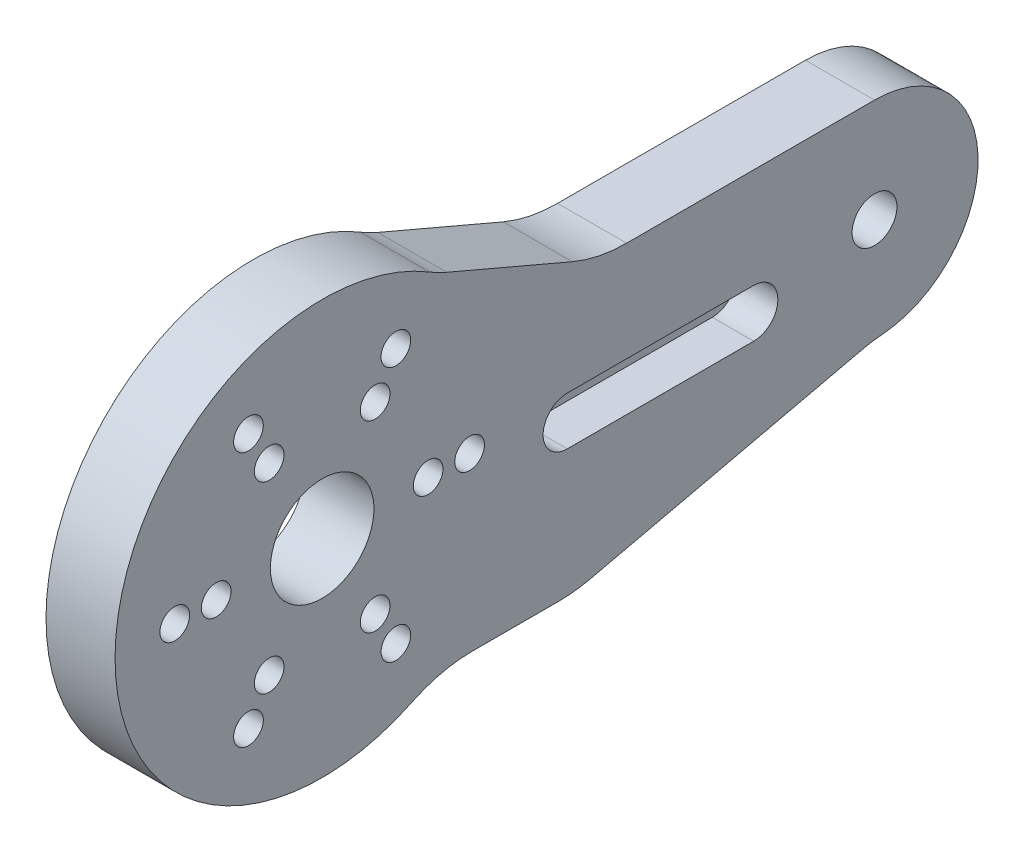
ISO-10303-21;
HEADER;
FILE_DESCRIPTION(('STEP AP214'),'2;1');
FILE_NAME('part.step','',(''),(''),'','','');
FILE_SCHEMA(('AUTOMOTIVE_DESIGN { 1 0 10303 214 1 1 1 1 }'));
ENDSEC;
DATA;
#1=APPLICATION_CONTEXT('core data for automotive mechanical design processes');
#2=APPLICATION_PROTOCOL_DEFINITION('international standard','automotive_design',2000,#1);
#3=PRODUCT_CONTEXT('',#1,'mechanical');
#4=PRODUCT('Part','Part','',(#3));
#5=PRODUCT_RELATED_PRODUCT_CATEGORY('part','',(#4));
#6=PRODUCT_DEFINITION_FORMATION('','',#4);
#7=PRODUCT_DEFINITION_CONTEXT('part definition',#1,'design');
#8=PRODUCT_DEFINITION('design','',#6,#7);
#9=PRODUCT_DEFINITION_SHAPE('','',#8);
#10=(LENGTH_UNIT() NAMED_UNIT(*) SI_UNIT(.MILLI.,.METRE.));
#11=(NAMED_UNIT(*) PLANE_ANGLE_UNIT() SI_UNIT($,.RADIAN.));
#12=(NAMED_UNIT(*) SI_UNIT($,.STERADIAN.) SOLID_ANGLE_UNIT());
#13=UNCERTAINTY_MEASURE_WITH_UNIT(LENGTH_MEASURE(1.E-05),#10,'distance_accuracy_value','');
#14=(GEOMETRIC_REPRESENTATION_CONTEXT(3) GLOBAL_UNCERTAINTY_ASSIGNED_CONTEXT((#13)) GLOBAL_UNIT_ASSIGNED_CONTEXT((#10,
#11,#12)) REPRESENTATION_CONTEXT('',''));
#15=CARTESIAN_POINT('',(0.,0.,0.));
#16=DIRECTION('',(0.,0.,1.));
#17=DIRECTION('',(1.,0.,0.));
#18=AXIS2_PLACEMENT_3D('',#15,#16,#17);
#19=CARTESIAN_POINT('',(-0.5,-1.5,-17.75));
#20=DIRECTION('',(1.,0.,0.));
#21=DIRECTION('',(0.,0.,-1.));
#22=AXIS2_PLACEMENT_3D('',#19,#20,#21);
#23=PLANE('',#22);
#24=CARTESIAN_POINT('',(-0.5,-1.5,-31.25));
#25=DIRECTION('',(1.,0.,0.));
#26=DIRECTION('',(0.,0.,-1.));
#27=AXIS2_PLACEMENT_3D('',#24,#25,#26);
#28=CIRCLE('',#27,1.75);
#29=CARTESIAN_POINT('',(-0.5,-3.25,-31.25));
#30=VERTEX_POINT('',#29);
#31=CARTESIAN_POINT('',(-0.5,0.250000000000001,-31.25));
#32=VERTEX_POINT('',#31);
#33=EDGE_CURVE('E142',#30,#32,#28,.T.);
#34=ORIENTED_EDGE('',*,*,#33,.T.);
#35=DIRECTION('',(0.,0.,1.));
#36=VECTOR('',#35,1.);
#37=CARTESIAN_POINT('',(-0.5,0.25,-17.75));
#38=LINE('',#37,#36);
#39=CARTESIAN_POINT('',(-0.5,0.25,-17.75));
#40=VERTEX_POINT('',#39);
#41=EDGE_CURVE('E132',#32,#40,#38,.T.);
#42=ORIENTED_EDGE('',*,*,#41,.T.);
#43=CARTESIAN_POINT('',(-0.5,-1.5,-17.75));
#44=DIRECTION('',(1.,0.,0.));
#45=DIRECTION('',(0.,0.,-1.));
#46=AXIS2_PLACEMENT_3D('',#43,#44,#45);
#47=CIRCLE('',#46,1.75);
#48=CARTESIAN_POINT('',(-0.5,-3.25,-17.75));
#49=VERTEX_POINT('',#48);
#50=EDGE_CURVE('E20',#40,#49,#47,.T.);
#51=ORIENTED_EDGE('',*,*,#50,.T.);
#52=DIRECTION('',(0.,0.,-1.));
#53=VECTOR('',#52,1.);
#54=CARTESIAN_POINT('',(-0.5,-3.25,-17.75));
#55=LINE('',#54,#53);
#56=EDGE_CURVE('E145',#49,#30,#55,.T.);
#57=ORIENTED_EDGE('',*,*,#56,.T.);
#58=EDGE_LOOP('',(#34,#42,#51,#57));
#59=FACE_BOUND('',#58,.T.);
#60=ADVANCED_FACE('F17',(#59),#23,.T.);
#61=CARTESIAN_POINT('',(-0.5,-1.5,-17.75));
#62=DIRECTION('',(1.,0.,0.));
#63=DIRECTION('',(0.,0.,-1.));
#64=AXIS2_PLACEMENT_3D('',#61,#62,#63);
#65=CYLINDRICAL_SURFACE('',#64,1.75);
#66=DIRECTION('',(1.,0.,0.));
#67=VECTOR('',#66,1.);
#68=CARTESIAN_POINT('',(-0.5,-3.25,-17.75));
#69=LINE('',#68,#67);
#70=CARTESIAN_POINT('',(2.5,-3.25,-17.75));
#71=VERTEX_POINT('',#70);
#72=EDGE_CURVE('E127',#71,#49,#69,.F.);
#73=ORIENTED_EDGE('',*,*,#72,.T.);
#74=ORIENTED_EDGE('',*,*,#50,.F.);
#75=DIRECTION('',(1.,0.,0.));
#76=VECTOR('',#75,1.);
#77=CARTESIAN_POINT('',(-0.5,0.25,-17.75));
#78=LINE('',#77,#76);
#79=CARTESIAN_POINT('',(2.5,0.25,-17.75));
#80=VERTEX_POINT('',#79);
#81=EDGE_CURVE('E125',#40,#80,#78,.T.);
#82=ORIENTED_EDGE('',*,*,#81,.T.);
#83=CARTESIAN_POINT('',(2.5,-1.5,-17.75));
#84=DIRECTION('',(1.,0.,0.));
#85=DIRECTION('',(0.,0.,-1.));
#86=AXIS2_PLACEMENT_3D('',#83,#84,#85);
#87=CIRCLE('',#86,1.75);
#88=EDGE_CURVE('E274',#71,#80,#87,.F.);
#89=ORIENTED_EDGE('',*,*,#88,.F.);
#90=EDGE_LOOP('',(#73,#74,#82,#89));
#91=FACE_BOUND('',#90,.T.);
#92=ADVANCED_FACE('F123',(#91),#65,.F.);
#93=CARTESIAN_POINT('',(-0.5,0.25,-17.75));
#94=DIRECTION('',(0.,1.,0.));
#95=DIRECTION('',(0.,0.,1.));
#96=AXIS2_PLACEMENT_3D('',#93,#94,#95);
#97=PLANE('',#96);
#98=ORIENTED_EDGE('',*,*,#81,.F.);
#99=ORIENTED_EDGE('',*,*,#41,.F.);
#100=DIRECTION('',(1.,0.,0.));
#101=VECTOR('',#100,1.);
#102=CARTESIAN_POINT('',(-0.5,0.250000000000001,-31.25));
#103=LINE('',#102,#101);
#104=CARTESIAN_POINT('',(2.5,0.250000000000001,-31.25));
#105=VERTEX_POINT('',#104);
#106=EDGE_CURVE('E140',#32,#105,#103,.T.);
#107=ORIENTED_EDGE('',*,*,#106,.T.);
#108=DIRECTION('',(0.,0.,-1.));
#109=VECTOR('',#108,1.);
#110=CARTESIAN_POINT('',(2.5,0.25,0.));
#111=LINE('',#110,#109);
#112=EDGE_CURVE('E139',#80,#105,#111,.T.);
#113=ORIENTED_EDGE('',*,*,#112,.F.);
#114=EDGE_LOOP('',(#98,#99,#107,#113));
#115=FACE_BOUND('',#114,.T.);
#116=ADVANCED_FACE('F135',(#115),#97,.F.);
#117=CARTESIAN_POINT('',(-0.5,-1.5,-31.25));
#118=DIRECTION('',(1.,0.,0.));
#119=DIRECTION('',(0.,0.,-1.));
#120=AXIS2_PLACEMENT_3D('',#117,#118,#119);
#121=CYLINDRICAL_SURFACE('',#120,1.75);
#122=ORIENTED_EDGE('',*,*,#33,.F.);
#123=DIRECTION('',(1.,0.,0.));
#124=VECTOR('',#123,1.);
#125=CARTESIAN_POINT('',(-0.5,-3.25,-31.25));
#126=LINE('',#125,#124);
#127=CARTESIAN_POINT('',(2.5,-3.25,-31.25));
#128=VERTEX_POINT('',#127);
#129=EDGE_CURVE('E279',#30,#128,#126,.T.);
#130=ORIENTED_EDGE('',*,*,#129,.T.);
#131=CARTESIAN_POINT('',(2.5,-1.5,-31.25));
#132=DIRECTION('',(1.,0.,0.));
#133=DIRECTION('',(0.,0.,-1.));
#134=AXIS2_PLACEMENT_3D('',#131,#132,#133);
#135=CIRCLE('',#134,1.75);
#136=EDGE_CURVE('E272',#105,#128,#135,.F.);
#137=ORIENTED_EDGE('',*,*,#136,.F.);
#138=ORIENTED_EDGE('',*,*,#106,.F.);
#139=EDGE_LOOP('',(#122,#130,#137,#138));
#140=FACE_BOUND('',#139,.T.);
#141=ADVANCED_FACE('F377',(#140),#121,.F.);
#142=CARTESIAN_POINT('',(-0.5,-3.25,-17.75));
#143=DIRECTION('',(0.,-1.,0.));
#144=DIRECTION('',(0.,0.,-1.));
#145=AXIS2_PLACEMENT_3D('',#142,#143,#144);
#146=PLANE('',#145);
#147=ORIENTED_EDGE('',*,*,#129,.F.);
#148=ORIENTED_EDGE('',*,*,#56,.F.);
#149=ORIENTED_EDGE('',*,*,#72,.F.);
#150=DIRECTION('',(0.,0.,-1.));
#151=VECTOR('',#150,1.);
#152=CARTESIAN_POINT('',(2.5,-3.25,0.));
#153=LINE('',#152,#151);
#154=EDGE_CURVE('E271',#128,#71,#153,.F.);
#155=ORIENTED_EDGE('',*,*,#154,.F.);
#156=EDGE_LOOP('',(#147,#148,#149,#155));
#157=FACE_BOUND('',#156,.T.);
#158=ADVANCED_FACE('F379',(#157),#146,.F.);
#159=CARTESIAN_POINT('',(2.5,21.3838228847909,-12.9511435337538));
#160=DIRECTION('',(-1.,0.,0.));
#161=DIRECTION('',(0.,0.,1.));
#162=AXIS2_PLACEMENT_3D('',#159,#160,#161);
#163=CYLINDRICAL_SURFACE('',#162,10.);
#164=DIRECTION('',(1.,0.,0.));
#165=VECTOR('',#164,1.);
#166=CARTESIAN_POINT('',(2.5,12.1872890829508,-9.02383325423511));
#167=LINE('',#166,#165);
#168=CARTESIAN_POINT('',(2.5,12.1872890829508,-9.02383325423511));
#169=VERTEX_POINT('',#168);
#170=CARTESIAN_POINT('',(-2.5,12.1872890829508,-9.02383325423511));
#171=VERTEX_POINT('',#170);
#172=EDGE_CURVE('E291',#169,#171,#167,.F.);
#173=ORIENTED_EDGE('',*,*,#172,.T.);
#174=CARTESIAN_POINT('',(-2.5,21.3838228847909,-12.9511435337538));
#175=DIRECTION('',(-1.,0.,0.));
#176=DIRECTION('',(0.,0.,1.));
#177=AXIS2_PLACEMENT_3D('',#174,#175,#176);
#178=CIRCLE('',#177,10.);
#179=CARTESIAN_POINT('',(-2.5,12.8302937308745,-7.77068612025227));
#180=VERTEX_POINT('',#179);
#181=EDGE_CURVE('E278',#180,#171,#178,.F.);
#182=ORIENTED_EDGE('',*,*,#181,.F.);
#183=DIRECTION('',(-1.,0.,0.));
#184=VECTOR('',#183,1.);
#185=CARTESIAN_POINT('',(2.5,12.8302937308745,-7.77068612025227));
#186=LINE('',#185,#184);
#187=CARTESIAN_POINT('',(2.5,12.8302937308745,-7.77068612025227));
#188=VERTEX_POINT('',#187);
#189=EDGE_CURVE('E257',#188,#180,#186,.T.);
#190=ORIENTED_EDGE('',*,*,#189,.F.);
#191=CARTESIAN_POINT('',(2.5,21.3838228847909,-12.9511435337538));
#192=DIRECTION('',(-1.,0.,0.));
#193=DIRECTION('',(0.,0.,1.));
#194=AXIS2_PLACEMENT_3D('',#191,#192,#193);
#195=CIRCLE('',#194,10.);
#196=EDGE_CURVE('E266',#169,#188,#195,.T.);
#197=ORIENTED_EDGE('',*,*,#196,.F.);
#198=EDGE_LOOP('',(#173,#182,#190,#197));
#199=FACE_BOUND('',#198,.T.);
#200=ADVANCED_FACE('F352',(#199),#163,.F.);
#201=CARTESIAN_POINT('',(2.5,-17.4463003681525,-41.3698917709806));
#202=DIRECTION('',(-1.,0.,0.));
#203=DIRECTION('',(0.,0.,1.));
#204=AXIS2_PLACEMENT_3D('',#201,#202,#203);
#205=CYLINDRICAL_SURFACE('',#204,10.);
#206=DIRECTION('',(1.,0.,0.));
#207=VECTOR('',#206,1.);
#208=CARTESIAN_POINT('',(2.5,-7.70144119055183,-39.1254052798805));
#209=LINE('',#208,#207);
#210=CARTESIAN_POINT('',(-2.5,-7.70144119055183,-39.1254052798805));
#211=VERTEX_POINT('',#210);
#212=CARTESIAN_POINT('',(2.5,-7.70144119055183,-39.1254052798805));
#213=VERTEX_POINT('',#212);
#214=EDGE_CURVE('E245',#211,#213,#209,.T.);
#215=ORIENTED_EDGE('',*,*,#214,.F.);
#216=CARTESIAN_POINT('',(-2.5,-17.4463003681525,-41.3698917709806));
#217=DIRECTION('',(-1.,0.,0.));
#218=DIRECTION('',(0.,0.,1.));
#219=AXIS2_PLACEMENT_3D('',#216,#217,#218);
#220=CIRCLE('',#219,10.);
#221=CARTESIAN_POINT('',(-2.5,-7.47698587206537,-40.5870964732774));
#222=VERTEX_POINT('',#221);
#223=EDGE_CURVE('E276',#222,#211,#220,.F.);
#224=ORIENTED_EDGE('',*,*,#223,.F.);
#225=DIRECTION('',(-1.,0.,0.));
#226=VECTOR('',#225,1.);
#227=CARTESIAN_POINT('',(2.5,-7.47698587206537,-40.5870964732774));
#228=LINE('',#227,#226);
#229=CARTESIAN_POINT('',(2.5,-7.47698587206537,-40.5870964732774));
#230=VERTEX_POINT('',#229);
#231=EDGE_CURVE('E265',#230,#222,#228,.T.);
#232=ORIENTED_EDGE('',*,*,#231,.F.);
#233=CARTESIAN_POINT('',(2.5,-17.4463003681525,-41.3698917709806));
#234=DIRECTION('',(-1.,0.,0.));
#235=DIRECTION('',(0.,0.,1.));
#236=AXIS2_PLACEMENT_3D('',#233,#234,#235);
#237=CIRCLE('',#236,10.);
#238=EDGE_CURVE('E269',#213,#230,#237,.T.);
#239=ORIENTED_EDGE('',*,*,#238,.F.);
#240=EDGE_LOOP('',(#215,#224,#232,#239));
#241=FACE_BOUND('',#240,.T.);
#242=ADVANCED_FACE('F367',(#241),#205,.F.);
#243=CARTESIAN_POINT('',(2.5,0.,0.));
#244=DIRECTION('',(1.,0.,0.));
#245=DIRECTION('',(0.,0.,-1.));
#246=AXIS2_PLACEMENT_3D('',#243,#244,#245);
#247=PLANE('',#246);
#248=CARTESIAN_POINT('',(2.5,0.,-40.));
#249=DIRECTION('',(-1.,0.,0.));
#250=DIRECTION('',(0.,0.,1.));
#251=AXIS2_PLACEMENT_3D('',#248,#249,#250);
#252=CIRCLE('',#251,1.625);
#253=CARTESIAN_POINT('',(2.5,0.,-38.375));
#254=VERTEX_POINT('',#253);
#255=EDGE_CURVE('E203',#254,#254,#252,.T.);
#256=ORIENTED_EDGE('',*,*,#255,.T.);
#257=EDGE_LOOP('',(#256));
#258=FACE_BOUND('',#257,.T.);
#259=CARTESIAN_POINT('',(2.5,0.,-10.675));
#260=DIRECTION('',(-1.,0.,0.));
#261=DIRECTION('',(0.,0.,1.));
#262=AXIS2_PLACEMENT_3D('',#259,#260,#261);
#263=CIRCLE('',#262,1.075);
#264=CARTESIAN_POINT('',(2.5,0.,-9.6));
#265=VERTEX_POINT('',#264);
#266=EDGE_CURVE('E206',#265,#265,#263,.T.);
#267=ORIENTED_EDGE('',*,*,#266,.T.);
#268=EDGE_LOOP('',(#267));
#269=FACE_BOUND('',#268,.T.);
#270=CARTESIAN_POINT('',(2.5,0.,-7.675));
#271=DIRECTION('',(-1.,0.,0.));
#272=DIRECTION('',(0.,0.,1.));
#273=AXIS2_PLACEMENT_3D('',#270,#271,#272);
#274=CIRCLE('',#273,1.075);
#275=CARTESIAN_POINT('',(2.5,0.,-6.6));
#276=VERTEX_POINT('',#275);
#277=EDGE_CURVE('E209',#276,#276,#274,.T.);
#278=ORIENTED_EDGE('',*,*,#277,.T.);
#279=EDGE_LOOP('',(#278));
#280=FACE_BOUND('',#279,.T.);
#281=CARTESIAN_POINT('',(2.5,0.,0.));
#282=DIRECTION('',(-1.,0.,0.));
#283=DIRECTION('',(0.,0.,1.));
#284=AXIS2_PLACEMENT_3D('',#281,#282,#283);
#285=CIRCLE('',#284,3.75);
#286=CARTESIAN_POINT('',(2.5,0.,3.75));
#287=VERTEX_POINT('',#286);
#288=EDGE_CURVE('E212',#287,#287,#285,.T.);
#289=ORIENTED_EDGE('',*,*,#288,.T.);
#290=EDGE_LOOP('',(#289));
#291=FACE_BOUND('',#290,.T.);
#292=CARTESIAN_POINT('',(2.5,-6.64674497404557,-3.8375));
#293=DIRECTION('',(-1.,0.,0.));
#294=DIRECTION('',(0.,0.,1.));
#295=AXIS2_PLACEMENT_3D('',#292,#293,#294);
#296=CIRCLE('',#295,1.075);
#297=CARTESIAN_POINT('',(2.5,-6.64674497404557,-2.7625));
#298=VERTEX_POINT('',#297);
#299=EDGE_CURVE('E215',#298,#298,#296,.T.);
#300=ORIENTED_EDGE('',*,*,#299,.T.);
#301=EDGE_LOOP('',(#300));
#302=FACE_BOUND('',#301,.T.);
#303=CARTESIAN_POINT('',(2.5,-9.24482118539888,-5.3375));
#304=DIRECTION('',(-1.,0.,0.));
#305=DIRECTION('',(0.,0.,1.));
#306=AXIS2_PLACEMENT_3D('',#303,#304,#305);
#307=CIRCLE('',#306,1.075);
#308=CARTESIAN_POINT('',(2.5,-9.24482118539888,-4.2625));
#309=VERTEX_POINT('',#308);
#310=EDGE_CURVE('E218',#309,#309,#307,.T.);
#311=ORIENTED_EDGE('',*,*,#310,.T.);
#312=EDGE_LOOP('',(#311));
#313=FACE_BOUND('',#312,.T.);
#314=CARTESIAN_POINT('',(2.5,-6.64674497404557,3.8375));
#315=DIRECTION('',(-1.,0.,0.));
#316=DIRECTION('',(0.,0.,1.));
#317=AXIS2_PLACEMENT_3D('',#314,#315,#316);
#318=CIRCLE('',#317,1.075);
#319=CARTESIAN_POINT('',(2.5,-6.64674497404557,4.9125));
#320=VERTEX_POINT('',#319);
#321=EDGE_CURVE('E221',#320,#320,#318,.T.);
#322=ORIENTED_EDGE('',*,*,#321,.T.);
#323=EDGE_LOOP('',(#322));
#324=FACE_BOUND('',#323,.T.);
#325=CARTESIAN_POINT('',(2.5,-9.24482118539888,5.3375));
#326=DIRECTION('',(-1.,0.,0.));
#327=DIRECTION('',(0.,0.,1.));
#328=AXIS2_PLACEMENT_3D('',#325,#326,#327);
#329=CIRCLE('',#328,1.075);
#330=CARTESIAN_POINT('',(2.5,-9.24482118539888,6.4125));
#331=VERTEX_POINT('',#330);
#332=EDGE_CURVE('E224',#331,#331,#329,.T.);
#333=ORIENTED_EDGE('',*,*,#332,.T.);
#334=EDGE_LOOP('',(#333));
#335=FACE_BOUND('',#334,.T.);
#336=CARTESIAN_POINT('',(2.5,0.,7.675));
#337=DIRECTION('',(-1.,0.,0.));
#338=DIRECTION('',(0.,0.,1.));
#339=AXIS2_PLACEMENT_3D('',#336,#337,#338);
#340=CIRCLE('',#339,1.075);
#341=CARTESIAN_POINT('',(2.5,0.,8.75));
#342=VERTEX_POINT('',#341);
#343=EDGE_CURVE('E227',#342,#342,#340,.T.);
#344=ORIENTED_EDGE('',*,*,#343,.T.);
#345=EDGE_LOOP('',(#344));
#346=FACE_BOUND('',#345,.T.);
#347=CARTESIAN_POINT('',(2.5,0.,10.675));
#348=DIRECTION('',(-1.,0.,0.));
#349=DIRECTION('',(0.,0.,1.));
#350=AXIS2_PLACEMENT_3D('',#347,#348,#349);
#351=CIRCLE('',#350,1.075);
#352=CARTESIAN_POINT('',(2.5,0.,11.75));
#353=VERTEX_POINT('',#352);
#354=EDGE_CURVE('E230',#353,#353,#351,.T.);
#355=ORIENTED_EDGE('',*,*,#354,.T.);
#356=EDGE_LOOP('',(#355));
#357=FACE_BOUND('',#356,.T.);
#358=CARTESIAN_POINT('',(2.5,6.64674497404556,3.8375));
#359=DIRECTION('',(-1.,0.,0.));
#360=DIRECTION('',(0.,0.,1.));
#361=AXIS2_PLACEMENT_3D('',#358,#359,#360);
#362=CIRCLE('',#361,1.075);
#363=CARTESIAN_POINT('',(2.5,6.64674497404556,4.9125));
#364=VERTEX_POINT('',#363);
#365=EDGE_CURVE('E233',#364,#364,#362,.T.);
#366=ORIENTED_EDGE('',*,*,#365,.T.);
#367=EDGE_LOOP('',(#366));
#368=FACE_BOUND('',#367,.T.);
#369=CARTESIAN_POINT('',(2.5,9.24482118539888,5.3375));
#370=DIRECTION('',(-1.,0.,0.));
#371=DIRECTION('',(0.,0.,1.));
#372=AXIS2_PLACEMENT_3D('',#369,#370,#371);
#373=CIRCLE('',#372,1.075);
#374=CARTESIAN_POINT('',(2.5,9.24482118539888,6.4125));
#375=VERTEX_POINT('',#374);
#376=EDGE_CURVE('E236',#375,#375,#373,.T.);
#377=ORIENTED_EDGE('',*,*,#376,.T.);
#378=EDGE_LOOP('',(#377));
#379=FACE_BOUND('',#378,.T.);
#380=CARTESIAN_POINT('',(2.5,6.64674497404557,-3.8375));
#381=DIRECTION('',(-1.,0.,0.));
#382=DIRECTION('',(0.,0.,1.));
#383=AXIS2_PLACEMENT_3D('',#380,#381,#382);
#384=CIRCLE('',#383,1.075);
#385=CARTESIAN_POINT('',(2.5,6.64674497404557,-2.7625));
#386=VERTEX_POINT('',#385);
#387=EDGE_CURVE('E239',#386,#386,#384,.T.);
#388=ORIENTED_EDGE('',*,*,#387,.T.);
#389=EDGE_LOOP('',(#388));
#390=FACE_BOUND('',#389,.T.);
#391=CARTESIAN_POINT('',(2.5,9.24482118539889,-5.33749999999999));
#392=DIRECTION('',(-1.,0.,0.));
#393=DIRECTION('',(0.,0.,1.));
#394=AXIS2_PLACEMENT_3D('',#391,#392,#393);
#395=CIRCLE('',#394,1.075);
#396=CARTESIAN_POINT('',(2.5,9.24482118539889,-4.26249999999999));
#397=VERTEX_POINT('',#396);
#398=EDGE_CURVE('E242',#397,#397,#395,.T.);
#399=ORIENTED_EDGE('',*,*,#398,.T.);
#400=EDGE_LOOP('',(#399));
#401=FACE_BOUND('',#400,.T.);
#402=CARTESIAN_POINT('',(2.5,0.,0.));
#403=DIRECTION('',(-1.,0.,0.));
#404=DIRECTION('',(0.,0.,1.));
#405=AXIS2_PLACEMENT_3D('',#402,#403,#404);
#406=CIRCLE('',#405,15.);
#407=CARTESIAN_POINT('',(2.5,-13.5,-6.53834841531101));
#408=VERTEX_POINT('',#407);
#409=EDGE_CURVE('E255',#408,#188,#406,.T.);
#410=ORIENTED_EDGE('',*,*,#409,.F.);
#411=CARTESIAN_POINT('',(2.5,-22.5,-10.8972473588517));
#412=DIRECTION('',(-1.,0.,0.));
#413=DIRECTION('',(0.,0.,1.));
#414=AXIS2_PLACEMENT_3D('',#411,#412,#413);
#415=CIRCLE('',#414,10.);
#416=CARTESIAN_POINT('',(2.5,-12.5,-10.8972473588517));
#417=VERTEX_POINT('',#416);
#418=EDGE_CURVE('E250',#408,#417,#415,.T.);
#419=ORIENTED_EDGE('',*,*,#418,.T.);
#420=DIRECTION('',(0.,0.,-1.));
#421=VECTOR('',#420,1.);
#422=CARTESIAN_POINT('',(2.5,-12.5,0.));
#423=LINE('',#422,#421);
#424=CARTESIAN_POINT('',(2.5,-12.5,-17.1548172308835));
#425=VERTEX_POINT('',#424);
#426=EDGE_CURVE('E253',#425,#417,#423,.F.);
#427=ORIENTED_EDGE('',*,*,#426,.F.);
#428=CARTESIAN_POINT('',(2.5,-2.5,-17.1548172308835));
#429=DIRECTION('',(-1.,0.,0.));
#430=DIRECTION('',(0.,0.,1.));
#431=AXIS2_PLACEMENT_3D('',#428,#429,#430);
#432=CIRCLE('',#431,10.);
#433=CARTESIAN_POINT('',(2.5,-12.2448591776007,-19.3993037219836));
#434=VERTEX_POINT('',#433);
#435=EDGE_CURVE('E246',#434,#425,#432,.T.);
#436=ORIENTED_EDGE('',*,*,#435,.F.);
#437=DIRECTION('',(0.,0.224448649110017,-0.974485917760071));
#438=VECTOR('',#437,1.);
#439=CARTESIAN_POINT('',(2.5,-15.8710529420645,-3.65550320212734));
#440=LINE('',#439,#438);
#441=EDGE_CURVE('E293',#213,#434,#440,.F.);
#442=ORIENTED_EDGE('',*,*,#441,.F.);
#443=ORIENTED_EDGE('',*,*,#238,.T.);
#444=CARTESIAN_POINT('',(2.5,0.,-40.));
#445=DIRECTION('',(-1.,0.,0.));
#446=DIRECTION('',(0.,0.,1.));
#447=AXIS2_PLACEMENT_3D('',#444,#445,#446);
#448=CIRCLE('',#447,7.5);
#449=CARTESIAN_POINT('',(2.5,7.5,-40.));
#450=VERTEX_POINT('',#449);
#451=EDGE_CURVE('E262',#450,#230,#448,.T.);
#452=ORIENTED_EDGE('',*,*,#451,.F.);
#453=DIRECTION('',(0.,0.,-1.));
#454=VECTOR('',#453,1.);
#455=CARTESIAN_POINT('',(2.5,7.49999999999999,0.));
#456=LINE('',#455,#454);
#457=CARTESIAN_POINT('',(2.5,7.5,-22.0458434423939));
#458=VERTEX_POINT('',#457);
#459=EDGE_CURVE('E285',#450,#458,#456,.F.);
#460=ORIENTED_EDGE('',*,*,#459,.T.);
#461=CARTESIAN_POINT('',(2.5,17.5,-22.0458434423939));
#462=DIRECTION('',(1.,0.,0.));
#463=DIRECTION('',(0.,0.,-1.));
#464=AXIS2_PLACEMENT_3D('',#461,#462,#463);
#465=CIRCLE('',#464,10.);
#466=CARTESIAN_POINT('',(2.5,8.30346619815993,-18.1185331628752));
#467=VERTEX_POINT('',#466);
#468=EDGE_CURVE('E258',#458,#467,#465,.F.);
#469=ORIENTED_EDGE('',*,*,#468,.T.);
#470=DIRECTION('',(0.,-0.392731027951867,-0.919653380184007));
#471=VECTOR('',#470,1.);
#472=CARTESIAN_POINT('',(2.5,13.5667458948105,-5.79357633651566));
#473=LINE('',#472,#471);
#474=EDGE_CURVE('E288',#467,#169,#473,.F.);
#475=ORIENTED_EDGE('',*,*,#474,.T.);
#476=ORIENTED_EDGE('',*,*,#196,.T.);
#477=EDGE_LOOP('',(#410,#419,#427,#436,#442,#443,#452,#460,#469,#475,#476));
#478=FACE_BOUND('',#477,.T.);
#479=ORIENTED_EDGE('',*,*,#136,.T.);
#480=ORIENTED_EDGE('',*,*,#154,.T.);
#481=ORIENTED_EDGE('',*,*,#88,.T.);
#482=ORIENTED_EDGE('',*,*,#112,.T.);
#483=EDGE_LOOP('',(#479,#480,#481,#482));
#484=FACE_BOUND('',#483,.T.);
#485=ADVANCED_FACE('F369',(#258,#269,#280,#291,#302,#313,#324,#335,#346,#357,#368,#379,#390,
#401,#478,#484),#247,.T.);
#486=CARTESIAN_POINT('',(2.5,0.,-40.));
#487=DIRECTION('',(-1.,0.,0.));
#488=DIRECTION('',(0.,0.,1.));
#489=AXIS2_PLACEMENT_3D('',#486,#487,#488);
#490=CYLINDRICAL_SURFACE('',#489,7.5);
#491=CARTESIAN_POINT('',(-2.5,0.,-40.));
#492=DIRECTION('',(-1.,0.,0.));
#493=DIRECTION('',(0.,0.,1.));
#494=AXIS2_PLACEMENT_3D('',#491,#492,#493);
#495=CIRCLE('',#494,7.5);
#496=CARTESIAN_POINT('',(-2.5,7.5,-40.));
#497=VERTEX_POINT('',#496);
#498=EDGE_CURVE('E200',#222,#497,#495,.F.);
#499=ORIENTED_EDGE('',*,*,#498,.T.);
#500=DIRECTION('',(1.,0.,0.));
#501=VECTOR('',#500,1.);
#502=CARTESIAN_POINT('',(2.5,7.5,-40.));
#503=LINE('',#502,#501);
#504=EDGE_CURVE('E287',#497,#450,#503,.T.);
#505=ORIENTED_EDGE('',*,*,#504,.T.);
#506=ORIENTED_EDGE('',*,*,#451,.T.);
#507=ORIENTED_EDGE('',*,*,#231,.T.);
#508=EDGE_LOOP('',(#499,#505,#506,#507));
#509=FACE_BOUND('',#508,.T.);
#510=ADVANCED_FACE('F364',(#509),#490,.T.);
#511=CARTESIAN_POINT('',(2.5,7.49999999999999,0.));
#512=DIRECTION('',(0.,-1.,0.));
#513=DIRECTION('',(0.,0.,-1.));
#514=AXIS2_PLACEMENT_3D('',#511,#512,#513);
#515=PLANE('',#514);
#516=DIRECTION('',(1.,0.,0.));
#517=VECTOR('',#516,1.);
#518=CARTESIAN_POINT('',(2.5,7.5,-22.0458434423939));
#519=LINE('',#518,#517);
#520=CARTESIAN_POINT('',(-2.5,7.5,-22.0458434423939));
#521=VERTEX_POINT('',#520);
#522=EDGE_CURVE('E261',#521,#458,#519,.T.);
#523=ORIENTED_EDGE('',*,*,#522,.T.);
#524=ORIENTED_EDGE('',*,*,#459,.F.);
#525=ORIENTED_EDGE('',*,*,#504,.F.);
#526=DIRECTION('',(0.,0.,-1.));
#527=VECTOR('',#526,1.);
#528=CARTESIAN_POINT('',(-2.5,7.5,0.));
#529=LINE('',#528,#527);
#530=EDGE_CURVE('E199',#497,#521,#529,.F.);
#531=ORIENTED_EDGE('',*,*,#530,.T.);
#532=EDGE_LOOP('',(#523,#524,#525,#531));
#533=FACE_BOUND('',#532,.T.);
#534=ADVANCED_FACE('F361',(#533),#515,.F.);
#535=CARTESIAN_POINT('',(2.5,17.5,-22.0458434423939));
#536=DIRECTION('',(1.,0.,0.));
#537=DIRECTION('',(0.,0.,-1.));
#538=AXIS2_PLACEMENT_3D('',#535,#536,#537);
#539=CYLINDRICAL_SURFACE('',#538,10.);
#540=ORIENTED_EDGE('',*,*,#522,.F.);
#541=CARTESIAN_POINT('',(-2.5,17.5,-22.0458434423939));
#542=DIRECTION('',(1.,0.,0.));
#543=DIRECTION('',(0.,0.,-1.));
#544=AXIS2_PLACEMENT_3D('',#541,#542,#543);
#545=CIRCLE('',#544,10.);
#546=CARTESIAN_POINT('',(-2.5,8.30346619815993,-18.1185331628752));
#547=VERTEX_POINT('',#546);
#548=EDGE_CURVE('E196',#521,#547,#545,.F.);
#549=ORIENTED_EDGE('',*,*,#548,.T.);
#550=DIRECTION('',(1.,0.,0.));
#551=VECTOR('',#550,1.);
#552=CARTESIAN_POINT('',(2.5,8.30346619815993,-18.1185331628752));
#553=LINE('',#552,#551);
#554=EDGE_CURVE('E260',#547,#467,#553,.T.);
#555=ORIENTED_EDGE('',*,*,#554,.T.);
#556=ORIENTED_EDGE('',*,*,#468,.F.);
#557=EDGE_LOOP('',(#540,#549,#555,#556));
#558=FACE_BOUND('',#557,.T.);
#559=ADVANCED_FACE('F358',(#558),#539,.F.);
#560=CARTESIAN_POINT('',(2.5,13.5667458948105,-5.79357633651566));
#561=DIRECTION('',(0.,-0.919653380184007,0.392731027951867));
#562=DIRECTION('',(0.,-0.392731027951867,-0.919653380184007));
#563=AXIS2_PLACEMENT_3D('',#560,#561,#562);
#564=PLANE('',#563);
#565=ORIENTED_EDGE('',*,*,#172,.F.);
#566=ORIENTED_EDGE('',*,*,#474,.F.);
#567=ORIENTED_EDGE('',*,*,#554,.F.);
#568=DIRECTION('',(0.,0.392731027951867,0.919653380184007));
#569=VECTOR('',#568,1.);
#570=CARTESIAN_POINT('',(-2.5,8.30346619815993,-18.1185331628752));
#571=LINE('',#570,#569);
#572=EDGE_CURVE('E195',#547,#171,#571,.T.);
#573=ORIENTED_EDGE('',*,*,#572,.T.);
#574=EDGE_LOOP('',(#565,#566,#567,#573));
#575=FACE_BOUND('',#574,.T.);
#576=ADVANCED_FACE('F355',(#575),#564,.F.);
#577=CARTESIAN_POINT('',(2.5,0.,0.));
#578=DIRECTION('',(-1.,0.,0.));
#579=DIRECTION('',(0.,0.,1.));
#580=AXIS2_PLACEMENT_3D('',#577,#578,#579);
#581=CYLINDRICAL_SURFACE('',#580,15.);
#582=CARTESIAN_POINT('',(-2.5,0.,0.));
#583=DIRECTION('',(-1.,0.,0.));
#584=DIRECTION('',(0.,0.,1.));
#585=AXIS2_PLACEMENT_3D('',#582,#583,#584);
#586=CIRCLE('',#585,15.);
#587=CARTESIAN_POINT('',(-2.5,-13.5,-6.53834841531101));
#588=VERTEX_POINT('',#587);
#589=EDGE_CURVE('E193',#180,#588,#586,.F.);
#590=ORIENTED_EDGE('',*,*,#589,.T.);
#591=DIRECTION('',(-1.,0.,0.));
#592=VECTOR('',#591,1.);
#593=CARTESIAN_POINT('',(2.5,-13.5,-6.53834841531101));
#594=LINE('',#593,#592);
#595=EDGE_CURVE('E254',#588,#408,#594,.F.);
#596=ORIENTED_EDGE('',*,*,#595,.T.);
#597=ORIENTED_EDGE('',*,*,#409,.T.);
#598=ORIENTED_EDGE('',*,*,#189,.T.);
#599=EDGE_LOOP('',(#590,#596,#597,#598));
#600=FACE_BOUND('',#599,.T.);
#601=ADVANCED_FACE('F346',(#600),#581,.T.);
#602=CARTESIAN_POINT('',(2.5,-22.5,-10.8972473588517));
#603=DIRECTION('',(-1.,0.,0.));
#604=DIRECTION('',(0.,0.,1.));
#605=AXIS2_PLACEMENT_3D('',#602,#603,#604);
#606=CYLINDRICAL_SURFACE('',#605,10.);
#607=ORIENTED_EDGE('',*,*,#595,.F.);
#608=CARTESIAN_POINT('',(-2.5,-22.5,-10.8972473588517));
#609=DIRECTION('',(-1.,0.,0.));
#610=DIRECTION('',(0.,0.,1.));
#611=AXIS2_PLACEMENT_3D('',#608,#609,#610);
#612=CIRCLE('',#611,10.);
#613=CARTESIAN_POINT('',(-2.5,-12.5,-10.8972473588517));
#614=VERTEX_POINT('',#613);
#615=EDGE_CURVE('E190',#588,#614,#612,.T.);
#616=ORIENTED_EDGE('',*,*,#615,.T.);
#617=DIRECTION('',(1.,0.,0.));
#618=VECTOR('',#617,1.);
#619=CARTESIAN_POINT('',(2.5,-12.5,-10.8972473588517));
#620=LINE('',#619,#618);
#621=EDGE_CURVE('E249',#417,#614,#620,.F.);
#622=ORIENTED_EDGE('',*,*,#621,.F.);
#623=ORIENTED_EDGE('',*,*,#418,.F.);
#624=EDGE_LOOP('',(#607,#616,#622,#623));
#625=FACE_BOUND('',#624,.T.);
#626=ADVANCED_FACE('F343',(#625),#606,.F.);
#627=CARTESIAN_POINT('',(2.5,-12.5,0.));
#628=DIRECTION('',(0.,-1.,0.));
#629=DIRECTION('',(0.,0.,-1.));
#630=AXIS2_PLACEMENT_3D('',#627,#628,#629);
#631=PLANE('',#630);
#632=ORIENTED_EDGE('',*,*,#426,.T.);
#633=ORIENTED_EDGE('',*,*,#621,.T.);
#634=DIRECTION('',(0.,0.,-1.));
#635=VECTOR('',#634,1.);
#636=CARTESIAN_POINT('',(-2.5,-12.5,0.));
#637=LINE('',#636,#635);
#638=CARTESIAN_POINT('',(-2.5,-12.5,-17.1548172308835));
#639=VERTEX_POINT('',#638);
#640=EDGE_CURVE('E189',#614,#639,#637,.T.);
#641=ORIENTED_EDGE('',*,*,#640,.T.);
#642=DIRECTION('',(-1.,0.,0.));
#643=VECTOR('',#642,1.);
#644=CARTESIAN_POINT('',(2.5,-12.5,-17.1548172308835));
#645=LINE('',#644,#643);
#646=EDGE_CURVE('E248',#425,#639,#645,.T.);
#647=ORIENTED_EDGE('',*,*,#646,.F.);
#648=EDGE_LOOP('',(#632,#633,#641,#647));
#649=FACE_BOUND('',#648,.T.);
#650=ADVANCED_FACE('F337',(#649),#631,.T.);
#651=CARTESIAN_POINT('',(2.5,-2.5,-17.1548172308835));
#652=DIRECTION('',(-1.,0.,0.));
#653=DIRECTION('',(0.,0.,1.));
#654=AXIS2_PLACEMENT_3D('',#651,#652,#653);
#655=CYLINDRICAL_SURFACE('',#654,10.);
#656=CARTESIAN_POINT('',(-2.5,-2.5,-17.1548172308835));
#657=DIRECTION('',(-1.,0.,0.));
#658=DIRECTION('',(0.,0.,1.));
#659=AXIS2_PLACEMENT_3D('',#656,#657,#658);
#660=CIRCLE('',#659,10.);
#661=CARTESIAN_POINT('',(-2.5,-12.2448591776007,-19.3993037219836));
#662=VERTEX_POINT('',#661);
#663=EDGE_CURVE('E186',#639,#662,#660,.F.);
#664=ORIENTED_EDGE('',*,*,#663,.T.);
#665=DIRECTION('',(1.,0.,0.));
#666=VECTOR('',#665,1.);
#667=CARTESIAN_POINT('',(2.5,-12.2448591776007,-19.3993037219836));
#668=LINE('',#667,#666);
#669=EDGE_CURVE('E35',#434,#662,#668,.F.);
#670=ORIENTED_EDGE('',*,*,#669,.F.);
#671=ORIENTED_EDGE('',*,*,#435,.T.);
#672=ORIENTED_EDGE('',*,*,#646,.T.);
#673=EDGE_LOOP('',(#664,#670,#671,#672));
#674=FACE_BOUND('',#673,.T.);
#675=ADVANCED_FACE('F332',(#674),#655,.T.);
#676=CARTESIAN_POINT('',(2.5,-15.8710529420645,-3.65550320212734));
#677=DIRECTION('',(0.,-0.974485917760071,-0.224448649110017));
#678=DIRECTION('',(0.,0.224448649110017,-0.974485917760071));
#679=AXIS2_PLACEMENT_3D('',#676,#677,#678);
#680=PLANE('',#679);
#681=DIRECTION('',(0.,0.224448649110017,-0.974485917760071));
#682=VECTOR('',#681,1.);
#683=CARTESIAN_POINT('',(-2.5,-12.2448591776007,-19.3993037219836));
#684=LINE('',#683,#682);
#685=EDGE_CURVE('E185',#662,#211,#684,.T.);
#686=ORIENTED_EDGE('',*,*,#685,.T.);
#687=ORIENTED_EDGE('',*,*,#214,.T.);
#688=ORIENTED_EDGE('',*,*,#441,.T.);
#689=ORIENTED_EDGE('',*,*,#669,.T.);
#690=EDGE_LOOP('',(#686,#687,#688,#689));
#691=FACE_BOUND('',#690,.T.);
#692=ADVANCED_FACE('F323',(#691),#680,.T.);
#693=CARTESIAN_POINT('',(2.5,9.24482118539889,-5.33749999999999));
#694=DIRECTION('',(-1.,0.,0.));
#695=DIRECTION('',(0.,0.,1.));
#696=AXIS2_PLACEMENT_3D('',#693,#694,#695);
#697=CYLINDRICAL_SURFACE('',#696,1.075);
#698=CARTESIAN_POINT('',(-2.5,9.24482118539889,-5.33749999999999));
#699=DIRECTION('',(-1.,0.,0.));
#700=DIRECTION('',(0.,0.,1.));
#701=AXIS2_PLACEMENT_3D('',#698,#699,#700);
#702=CIRCLE('',#701,1.075);
#703=CARTESIAN_POINT('',(-2.5,9.24482118539889,-4.26249999999999));
#704=VERTEX_POINT('',#703);
#705=EDGE_CURVE('E182',#704,#704,#702,.T.);
#706=ORIENTED_EDGE('',*,*,#705,.T.);
#707=EDGE_LOOP('',(#706));
#708=FACE_BOUND('',#707,.T.);
#709=ORIENTED_EDGE('',*,*,#398,.F.);
#710=EDGE_LOOP('',(#709));
#711=FACE_BOUND('',#710,.T.);
#712=ADVANCED_FACE('F448',(#708,#711),#697,.F.);
#713=CARTESIAN_POINT('',(2.5,6.64674497404557,-3.8375));
#714=DIRECTION('',(-1.,0.,0.));
#715=DIRECTION('',(0.,0.,1.));
#716=AXIS2_PLACEMENT_3D('',#713,#714,#715);
#717=CYLINDRICAL_SURFACE('',#716,1.075);
#718=CARTESIAN_POINT('',(-2.5,6.64674497404557,-3.8375));
#719=DIRECTION('',(-1.,0.,0.));
#720=DIRECTION('',(0.,0.,1.));
#721=AXIS2_PLACEMENT_3D('',#718,#719,#720);
#722=CIRCLE('',#721,1.075);
#723=CARTESIAN_POINT('',(-2.5,6.64674497404557,-2.7625));
#724=VERTEX_POINT('',#723);
#725=EDGE_CURVE('E179',#724,#724,#722,.T.);
#726=ORIENTED_EDGE('',*,*,#725,.T.);
#727=EDGE_LOOP('',(#726));
#728=FACE_BOUND('',#727,.T.);
#729=ORIENTED_EDGE('',*,*,#387,.F.);
#730=EDGE_LOOP('',(#729));
#731=FACE_BOUND('',#730,.T.);
#732=ADVANCED_FACE('F444',(#728,#731),#717,.F.);
#733=CARTESIAN_POINT('',(2.5,9.24482118539888,5.3375));
#734=DIRECTION('',(-1.,0.,0.));
#735=DIRECTION('',(0.,0.,1.));
#736=AXIS2_PLACEMENT_3D('',#733,#734,#735);
#737=CYLINDRICAL_SURFACE('',#736,1.075);
#738=CARTESIAN_POINT('',(-2.5,9.24482118539888,5.3375));
#739=DIRECTION('',(-1.,0.,0.));
#740=DIRECTION('',(0.,0.,1.));
#741=AXIS2_PLACEMENT_3D('',#738,#739,#740);
#742=CIRCLE('',#741,1.075);
#743=CARTESIAN_POINT('',(-2.5,9.24482118539888,6.4125));
#744=VERTEX_POINT('',#743);
#745=EDGE_CURVE('E176',#744,#744,#742,.T.);
#746=ORIENTED_EDGE('',*,*,#745,.T.);
#747=EDGE_LOOP('',(#746));
#748=FACE_BOUND('',#747,.T.);
#749=ORIENTED_EDGE('',*,*,#376,.F.);
#750=EDGE_LOOP('',(#749));
#751=FACE_BOUND('',#750,.T.);
#752=ADVANCED_FACE('F440',(#748,#751),#737,.F.);
#753=CARTESIAN_POINT('',(2.5,6.64674497404556,3.8375));
#754=DIRECTION('',(-1.,0.,0.));
#755=DIRECTION('',(0.,0.,1.));
#756=AXIS2_PLACEMENT_3D('',#753,#754,#755);
#757=CYLINDRICAL_SURFACE('',#756,1.075);
#758=CARTESIAN_POINT('',(-2.5,6.64674497404556,3.8375));
#759=DIRECTION('',(-1.,0.,0.));
#760=DIRECTION('',(0.,0.,1.));
#761=AXIS2_PLACEMENT_3D('',#758,#759,#760);
#762=CIRCLE('',#761,1.075);
#763=CARTESIAN_POINT('',(-2.5,6.64674497404556,4.9125));
#764=VERTEX_POINT('',#763);
#765=EDGE_CURVE('E173',#764,#764,#762,.T.);
#766=ORIENTED_EDGE('',*,*,#765,.T.);
#767=EDGE_LOOP('',(#766));
#768=FACE_BOUND('',#767,.T.);
#769=ORIENTED_EDGE('',*,*,#365,.F.);
#770=EDGE_LOOP('',(#769));
#771=FACE_BOUND('',#770,.T.);
#772=ADVANCED_FACE('F436',(#768,#771),#757,.F.);
#773=CARTESIAN_POINT('',(2.5,0.,10.675));
#774=DIRECTION('',(-1.,0.,0.));
#775=DIRECTION('',(0.,0.,1.));
#776=AXIS2_PLACEMENT_3D('',#773,#774,#775);
#777=CYLINDRICAL_SURFACE('',#776,1.075);
#778=CARTESIAN_POINT('',(-2.5,0.,10.675));
#779=DIRECTION('',(-1.,0.,0.));
#780=DIRECTION('',(0.,0.,1.));
#781=AXIS2_PLACEMENT_3D('',#778,#779,#780);
#782=CIRCLE('',#781,1.075);
#783=CARTESIAN_POINT('',(-2.5,0.,11.75));
#784=VERTEX_POINT('',#783);
#785=EDGE_CURVE('E170',#784,#784,#782,.T.);
#786=ORIENTED_EDGE('',*,*,#785,.T.);
#787=EDGE_LOOP('',(#786));
#788=FACE_BOUND('',#787,.T.);
#789=ORIENTED_EDGE('',*,*,#354,.F.);
#790=EDGE_LOOP('',(#789));
#791=FACE_BOUND('',#790,.T.);
#792=ADVANCED_FACE('F432',(#788,#791),#777,.F.);
#793=CARTESIAN_POINT('',(2.5,0.,7.675));
#794=DIRECTION('',(-1.,0.,0.));
#795=DIRECTION('',(0.,0.,1.));
#796=AXIS2_PLACEMENT_3D('',#793,#794,#795);
#797=CYLINDRICAL_SURFACE('',#796,1.075);
#798=CARTESIAN_POINT('',(-2.5,0.,7.675));
#799=DIRECTION('',(-1.,0.,0.));
#800=DIRECTION('',(0.,0.,1.));
#801=AXIS2_PLACEMENT_3D('',#798,#799,#800);
#802=CIRCLE('',#801,1.075);
#803=CARTESIAN_POINT('',(-2.5,0.,8.75));
#804=VERTEX_POINT('',#803);
#805=EDGE_CURVE('E167',#804,#804,#802,.T.);
#806=ORIENTED_EDGE('',*,*,#805,.T.);
#807=EDGE_LOOP('',(#806));
#808=FACE_BOUND('',#807,.T.);
#809=ORIENTED_EDGE('',*,*,#343,.F.);
#810=EDGE_LOOP('',(#809));
#811=FACE_BOUND('',#810,.T.);
#812=ADVANCED_FACE('F428',(#808,#811),#797,.F.);
#813=CARTESIAN_POINT('',(2.5,-9.24482118539888,5.3375));
#814=DIRECTION('',(-1.,0.,0.));
#815=DIRECTION('',(0.,0.,1.));
#816=AXIS2_PLACEMENT_3D('',#813,#814,#815);
#817=CYLINDRICAL_SURFACE('',#816,1.075);
#818=CARTESIAN_POINT('',(-2.5,-9.24482118539888,5.3375));
#819=DIRECTION('',(-1.,0.,0.));
#820=DIRECTION('',(0.,0.,1.));
#821=AXIS2_PLACEMENT_3D('',#818,#819,#820);
#822=CIRCLE('',#821,1.075);
#823=CARTESIAN_POINT('',(-2.5,-9.24482118539888,6.4125));
#824=VERTEX_POINT('',#823);
#825=EDGE_CURVE('E164',#824,#824,#822,.T.);
#826=ORIENTED_EDGE('',*,*,#825,.T.);
#827=EDGE_LOOP('',(#826));
#828=FACE_BOUND('',#827,.T.);
#829=ORIENTED_EDGE('',*,*,#332,.F.);
#830=EDGE_LOOP('',(#829));
#831=FACE_BOUND('',#830,.T.);
#832=ADVANCED_FACE('F424',(#828,#831),#817,.F.);
#833=CARTESIAN_POINT('',(2.5,-6.64674497404557,3.8375));
#834=DIRECTION('',(-1.,0.,0.));
#835=DIRECTION('',(0.,0.,1.));
#836=AXIS2_PLACEMENT_3D('',#833,#834,#835);
#837=CYLINDRICAL_SURFACE('',#836,1.075);
#838=CARTESIAN_POINT('',(-2.5,-6.64674497404557,3.8375));
#839=DIRECTION('',(-1.,0.,0.));
#840=DIRECTION('',(0.,0.,1.));
#841=AXIS2_PLACEMENT_3D('',#838,#839,#840);
#842=CIRCLE('',#841,1.075);
#843=CARTESIAN_POINT('',(-2.5,-6.64674497404557,4.9125));
#844=VERTEX_POINT('',#843);
#845=EDGE_CURVE('E161',#844,#844,#842,.T.);
#846=ORIENTED_EDGE('',*,*,#845,.T.);
#847=EDGE_LOOP('',(#846));
#848=FACE_BOUND('',#847,.T.);
#849=ORIENTED_EDGE('',*,*,#321,.F.);
#850=EDGE_LOOP('',(#849));
#851=FACE_BOUND('',#850,.T.);
#852=ADVANCED_FACE('F420',(#848,#851),#837,.F.);
#853=CARTESIAN_POINT('',(2.5,-9.24482118539888,-5.3375));
#854=DIRECTION('',(-1.,0.,0.));
#855=DIRECTION('',(0.,0.,1.));
#856=AXIS2_PLACEMENT_3D('',#853,#854,#855);
#857=CYLINDRICAL_SURFACE('',#856,1.075);
#858=CARTESIAN_POINT('',(-2.5,-9.24482118539888,-5.3375));
#859=DIRECTION('',(-1.,0.,0.));
#860=DIRECTION('',(0.,0.,1.));
#861=AXIS2_PLACEMENT_3D('',#858,#859,#860);
#862=CIRCLE('',#861,1.075);
#863=CARTESIAN_POINT('',(-2.5,-9.24482118539888,-4.2625));
#864=VERTEX_POINT('',#863);
#865=EDGE_CURVE('E158',#864,#864,#862,.T.);
#866=ORIENTED_EDGE('',*,*,#865,.T.);
#867=EDGE_LOOP('',(#866));
#868=FACE_BOUND('',#867,.T.);
#869=ORIENTED_EDGE('',*,*,#310,.F.);
#870=EDGE_LOOP('',(#869));
#871=FACE_BOUND('',#870,.T.);
#872=ADVANCED_FACE('F416',(#868,#871),#857,.F.);
#873=CARTESIAN_POINT('',(2.5,-6.64674497404557,-3.8375));
#874=DIRECTION('',(-1.,0.,0.));
#875=DIRECTION('',(0.,0.,1.));
#876=AXIS2_PLACEMENT_3D('',#873,#874,#875);
#877=CYLINDRICAL_SURFACE('',#876,1.075);
#878=CARTESIAN_POINT('',(-2.5,-6.64674497404557,-3.8375));
#879=DIRECTION('',(-1.,0.,0.));
#880=DIRECTION('',(0.,0.,1.));
#881=AXIS2_PLACEMENT_3D('',#878,#879,#880);
#882=CIRCLE('',#881,1.075);
#883=CARTESIAN_POINT('',(-2.5,-6.64674497404557,-2.7625));
#884=VERTEX_POINT('',#883);
#885=EDGE_CURVE('E155',#884,#884,#882,.T.);
#886=ORIENTED_EDGE('',*,*,#885,.T.);
#887=EDGE_LOOP('',(#886));
#888=FACE_BOUND('',#887,.T.);
#889=ORIENTED_EDGE('',*,*,#299,.F.);
#890=EDGE_LOOP('',(#889));
#891=FACE_BOUND('',#890,.T.);
#892=ADVANCED_FACE('F412',(#888,#891),#877,.F.);
#893=CARTESIAN_POINT('',(2.5,0.,0.));
#894=DIRECTION('',(-1.,0.,0.));
#895=DIRECTION('',(0.,0.,1.));
#896=AXIS2_PLACEMENT_3D('',#893,#894,#895);
#897=CYLINDRICAL_SURFACE('',#896,3.75);
#898=CARTESIAN_POINT('',(-2.5,0.,0.));
#899=DIRECTION('',(-1.,0.,0.));
#900=DIRECTION('',(0.,0.,1.));
#901=AXIS2_PLACEMENT_3D('',#898,#899,#900);
#902=CIRCLE('',#901,3.75);
#903=CARTESIAN_POINT('',(-2.5,0.,3.75));
#904=VERTEX_POINT('',#903);
#905=EDGE_CURVE('E152',#904,#904,#902,.T.);
#906=ORIENTED_EDGE('',*,*,#905,.T.);
#907=EDGE_LOOP('',(#906));
#908=FACE_BOUND('',#907,.T.);
#909=ORIENTED_EDGE('',*,*,#288,.F.);
#910=EDGE_LOOP('',(#909));
#911=FACE_BOUND('',#910,.T.);
#912=ADVANCED_FACE('F408',(#908,#911),#897,.F.);
#913=CARTESIAN_POINT('',(2.5,0.,-7.675));
#914=DIRECTION('',(-1.,0.,0.));
#915=DIRECTION('',(0.,0.,1.));
#916=AXIS2_PLACEMENT_3D('',#913,#914,#915);
#917=CYLINDRICAL_SURFACE('',#916,1.075);
#918=CARTESIAN_POINT('',(-2.5,0.,-7.675));
#919=DIRECTION('',(-1.,0.,0.));
#920=DIRECTION('',(0.,0.,1.));
#921=AXIS2_PLACEMENT_3D('',#918,#919,#920);
#922=CIRCLE('',#921,1.075);
#923=CARTESIAN_POINT('',(-2.5,0.,-6.6));
#924=VERTEX_POINT('',#923);
#925=EDGE_CURVE('E149',#924,#924,#922,.T.);
#926=ORIENTED_EDGE('',*,*,#925,.T.);
#927=EDGE_LOOP('',(#926));
#928=FACE_BOUND('',#927,.T.);
#929=ORIENTED_EDGE('',*,*,#277,.F.);
#930=EDGE_LOOP('',(#929));
#931=FACE_BOUND('',#930,.T.);
#932=ADVANCED_FACE('F404',(#928,#931),#917,.F.);
#933=CARTESIAN_POINT('',(2.5,0.,-10.675));
#934=DIRECTION('',(-1.,0.,0.));
#935=DIRECTION('',(0.,0.,1.));
#936=AXIS2_PLACEMENT_3D('',#933,#934,#935);
#937=CYLINDRICAL_SURFACE('',#936,1.075);
#938=CARTESIAN_POINT('',(-2.5,0.,-10.675));
#939=DIRECTION('',(-1.,0.,0.));
#940=DIRECTION('',(0.,0.,1.));
#941=AXIS2_PLACEMENT_3D('',#938,#939,#940);
#942=CIRCLE('',#941,1.075);
#943=CARTESIAN_POINT('',(-2.5,0.,-9.6));
#944=VERTEX_POINT('',#943);
#945=EDGE_CURVE('E26',#944,#944,#942,.T.);
#946=ORIENTED_EDGE('',*,*,#945,.T.);
#947=EDGE_LOOP('',(#946));
#948=FACE_BOUND('',#947,.T.);
#949=ORIENTED_EDGE('',*,*,#266,.F.);
#950=EDGE_LOOP('',(#949));
#951=FACE_BOUND('',#950,.T.);
#952=ADVANCED_FACE('F396',(#948,#951),#937,.F.);
#953=CARTESIAN_POINT('',(2.5,0.,-40.));
#954=DIRECTION('',(-1.,0.,0.));
#955=DIRECTION('',(0.,0.,1.));
#956=AXIS2_PLACEMENT_3D('',#953,#954,#955);
#957=CYLINDRICAL_SURFACE('',#956,1.625);
#958=CARTESIAN_POINT('',(-2.5,0.,-40.));
#959=DIRECTION('',(-1.,0.,0.));
#960=DIRECTION('',(0.,0.,1.));
#961=AXIS2_PLACEMENT_3D('',#958,#959,#960);
#962=CIRCLE('',#961,1.625);
#963=CARTESIAN_POINT('',(-2.5,0.,-38.375));
#964=VERTEX_POINT('',#963);
#965=EDGE_CURVE('E11',#964,#964,#962,.T.);
#966=ORIENTED_EDGE('',*,*,#965,.T.);
#967=EDGE_LOOP('',(#966));
#968=FACE_BOUND('',#967,.T.);
#969=ORIENTED_EDGE('',*,*,#255,.F.);
#970=EDGE_LOOP('',(#969));
#971=FACE_BOUND('',#970,.T.);
#972=ADVANCED_FACE('F390',(#968,#971),#957,.F.);
#973=CARTESIAN_POINT('',(-2.5,0.,0.));
#974=DIRECTION('',(1.,0.,0.));
#975=DIRECTION('',(0.,0.,-1.));
#976=AXIS2_PLACEMENT_3D('',#973,#974,#975);
#977=PLANE('',#976);
#978=ORIENTED_EDGE('',*,*,#965,.F.);
#979=EDGE_LOOP('',(#978));
#980=FACE_BOUND('',#979,.T.);
#981=ORIENTED_EDGE('',*,*,#945,.F.);
#982=EDGE_LOOP('',(#981));
#983=FACE_BOUND('',#982,.T.);
#984=ORIENTED_EDGE('',*,*,#925,.F.);
#985=EDGE_LOOP('',(#984));
#986=FACE_BOUND('',#985,.T.);
#987=ORIENTED_EDGE('',*,*,#905,.F.);
#988=EDGE_LOOP('',(#987));
#989=FACE_BOUND('',#988,.T.);
#990=ORIENTED_EDGE('',*,*,#885,.F.);
#991=EDGE_LOOP('',(#990));
#992=FACE_BOUND('',#991,.T.);
#993=ORIENTED_EDGE('',*,*,#865,.F.);
#994=EDGE_LOOP('',(#993));
#995=FACE_BOUND('',#994,.T.);
#996=ORIENTED_EDGE('',*,*,#845,.F.);
#997=EDGE_LOOP('',(#996));
#998=FACE_BOUND('',#997,.T.);
#999=ORIENTED_EDGE('',*,*,#825,.F.);
#1000=EDGE_LOOP('',(#999));
#1001=FACE_BOUND('',#1000,.T.);
#1002=ORIENTED_EDGE('',*,*,#805,.F.);
#1003=EDGE_LOOP('',(#1002));
#1004=FACE_BOUND('',#1003,.T.);
#1005=ORIENTED_EDGE('',*,*,#785,.F.);
#1006=EDGE_LOOP('',(#1005));
#1007=FACE_BOUND('',#1006,.T.);
#1008=ORIENTED_EDGE('',*,*,#765,.F.);
#1009=EDGE_LOOP('',(#1008));
#1010=FACE_BOUND('',#1009,.T.);
#1011=ORIENTED_EDGE('',*,*,#745,.F.);
#1012=EDGE_LOOP('',(#1011));
#1013=FACE_BOUND('',#1012,.T.);
#1014=ORIENTED_EDGE('',*,*,#725,.F.);
#1015=EDGE_LOOP('',(#1014));
#1016=FACE_BOUND('',#1015,.T.);
#1017=ORIENTED_EDGE('',*,*,#705,.F.);
#1018=EDGE_LOOP('',(#1017));
#1019=FACE_BOUND('',#1018,.T.);
#1020=ORIENTED_EDGE('',*,*,#663,.F.);
#1021=ORIENTED_EDGE('',*,*,#640,.F.);
#1022=ORIENTED_EDGE('',*,*,#615,.F.);
#1023=ORIENTED_EDGE('',*,*,#589,.F.);
#1024=ORIENTED_EDGE('',*,*,#181,.T.);
#1025=ORIENTED_EDGE('',*,*,#572,.F.);
#1026=ORIENTED_EDGE('',*,*,#548,.F.);
#1027=ORIENTED_EDGE('',*,*,#530,.F.);
#1028=ORIENTED_EDGE('',*,*,#498,.F.);
#1029=ORIENTED_EDGE('',*,*,#223,.T.);
#1030=ORIENTED_EDGE('',*,*,#685,.F.);
#1031=EDGE_LOOP('',(#1020,#1021,#1022,#1023,#1024,#1025,#1026,#1027,#1028,#1029,#1030));
#1032=FACE_BOUND('',#1031,.T.);
#1033=ADVANCED_FACE('F328',(#980,#983,#986,#989,#992,#995,#998,#1001,#1004,#1007,#1010,#1013,
#1016,#1019,#1032),#977,.F.);
#1034=CLOSED_SHELL('',(#60,#92,#116,#141,#158,#200,#242,#485,#510,#534,#559,#576,#601,#626,#650,
#675,#692,#712,#732,#752,#772,#792,#812,#832,#852,#872,#892,#912,#932,#952,#972,#1033));
#1035=MANIFOLD_SOLID_BREP('B1',#1034);
#1036=ADVANCED_BREP_SHAPE_REPRESENTATION('',(#18,#1035),#14);
#1037=SHAPE_DEFINITION_REPRESENTATION(#9,#1036);
ENDSEC;
END-ISO-10303-21;
